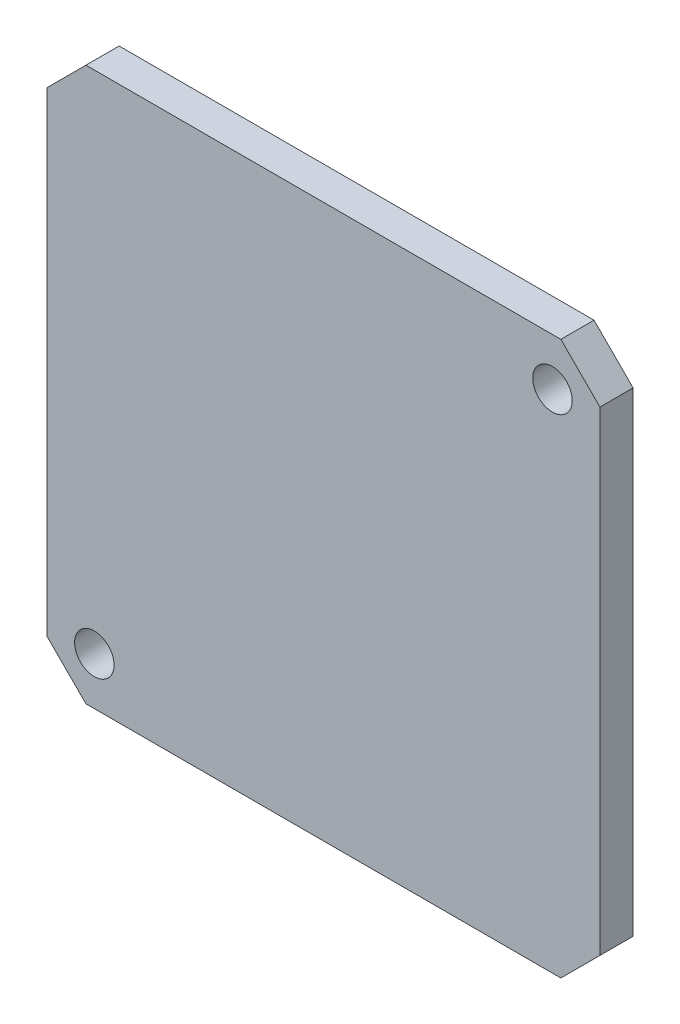
ISO-10303-21;
HEADER;
FILE_DESCRIPTION(('STEP AP214'),'2;1');
FILE_NAME('part.step','',(''),(''),'','','');
FILE_SCHEMA(('AUTOMOTIVE_DESIGN { 1 0 10303 214 1 1 1 1 }'));
ENDSEC;
DATA;
#1=APPLICATION_CONTEXT('core data for automotive mechanical design processes');
#2=APPLICATION_PROTOCOL_DEFINITION('international standard','automotive_design',2000,#1);
#3=PRODUCT_CONTEXT('',#1,'mechanical');
#4=PRODUCT('Part','Part','',(#3));
#5=PRODUCT_RELATED_PRODUCT_CATEGORY('part','',(#4));
#6=PRODUCT_DEFINITION_FORMATION('','',#4);
#7=PRODUCT_DEFINITION_CONTEXT('part definition',#1,'design');
#8=PRODUCT_DEFINITION('design','',#6,#7);
#9=PRODUCT_DEFINITION_SHAPE('','',#8);
#10=(LENGTH_UNIT() NAMED_UNIT(*) SI_UNIT(.MILLI.,.METRE.));
#11=(NAMED_UNIT(*) PLANE_ANGLE_UNIT() SI_UNIT($,.RADIAN.));
#12=(NAMED_UNIT(*) SI_UNIT($,.STERADIAN.) SOLID_ANGLE_UNIT());
#13=UNCERTAINTY_MEASURE_WITH_UNIT(LENGTH_MEASURE(1.E-05),#10,'distance_accuracy_value','');
#14=(GEOMETRIC_REPRESENTATION_CONTEXT(3) GLOBAL_UNCERTAINTY_ASSIGNED_CONTEXT((#13)) GLOBAL_UNIT_ASSIGNED_CONTEXT((#10,
#11,#12)) REPRESENTATION_CONTEXT('',''));
#15=CARTESIAN_POINT('',(0.,0.,0.));
#16=DIRECTION('',(0.,0.,1.));
#17=DIRECTION('',(1.,0.,0.));
#18=AXIS2_PLACEMENT_3D('',#15,#16,#17);
#19=CARTESIAN_POINT('',(0.,0.,2.1));
#20=DIRECTION('',(0.,0.,1.));
#21=DIRECTION('',(1.,0.,0.));
#22=AXIS2_PLACEMENT_3D('',#19,#20,#21);
#23=PLANE('',#22);
#24=CARTESIAN_POINT('',(14.4956890143242,14.4956890143242,2.1));
#25=DIRECTION('',(0.,0.,1.));
#26=DIRECTION('',(1.,0.,0.));
#27=AXIS2_PLACEMENT_3D('',#24,#25,#26);
#28=CIRCLE('',#27,1.25);
#29=CARTESIAN_POINT('',(15.7456890143242,14.4956890143242,2.1));
#30=VERTEX_POINT('',#29);
#31=EDGE_CURVE('E133',#30,#30,#28,.T.);
#32=ORIENTED_EDGE('',*,*,#31,.F.);
#33=EDGE_LOOP('',(#32));
#34=FACE_BOUND('',#33,.T.);
#35=DIRECTION('',(-0.707106781186548,-0.707106781186548,0.));
#36=VECTOR('',#35,1.);
#37=CARTESIAN_POINT('',(-15.0269119345812,17.5,2.1));
#38=LINE('',#37,#36);
#39=CARTESIAN_POINT('',(-15.0269119345812,17.5,2.1));
#40=VERTEX_POINT('',#39);
#41=CARTESIAN_POINT('',(-17.5,15.0269119345812,2.1));
#42=VERTEX_POINT('',#41);
#43=EDGE_CURVE('E144',#40,#42,#38,.T.);
#44=ORIENTED_EDGE('',*,*,#43,.T.);
#45=DIRECTION('',(0.,-1.,0.));
#46=VECTOR('',#45,1.);
#47=CARTESIAN_POINT('',(-17.5,15.0269119345812,2.1));
#48=LINE('',#47,#46);
#49=CARTESIAN_POINT('',(-17.5,-15.0269119345812,2.1));
#50=VERTEX_POINT('',#49);
#51=EDGE_CURVE('E92',#42,#50,#48,.T.);
#52=ORIENTED_EDGE('',*,*,#51,.T.);
#53=DIRECTION('',(0.707106781186548,-0.707106781186548,0.));
#54=VECTOR('',#53,1.);
#55=CARTESIAN_POINT('',(-17.5,-15.0269119345812,2.1));
#56=LINE('',#55,#54);
#57=CARTESIAN_POINT('',(-15.0269119345812,-17.5,2.1));
#58=VERTEX_POINT('',#57);
#59=EDGE_CURVE('E159',#50,#58,#56,.T.);
#60=ORIENTED_EDGE('',*,*,#59,.T.);
#61=DIRECTION('',(1.,0.,0.));
#62=VECTOR('',#61,1.);
#63=CARTESIAN_POINT('',(-15.0269119345812,-17.5,2.1));
#64=LINE('',#63,#62);
#65=CARTESIAN_POINT('',(15.0269119345812,-17.5,2.1));
#66=VERTEX_POINT('',#65);
#67=EDGE_CURVE('E172',#58,#66,#64,.T.);
#68=ORIENTED_EDGE('',*,*,#67,.T.);
#69=DIRECTION('',(0.707106781186548,0.707106781186548,0.));
#70=VECTOR('',#69,1.);
#71=CARTESIAN_POINT('',(15.0269119345812,-17.5,2.1));
#72=LINE('',#71,#70);
#73=CARTESIAN_POINT('',(17.5,-15.0269119345812,2.1));
#74=VERTEX_POINT('',#73);
#75=EDGE_CURVE('E111',#66,#74,#72,.T.);
#76=ORIENTED_EDGE('',*,*,#75,.T.);
#77=DIRECTION('',(0.,1.,0.));
#78=VECTOR('',#77,1.);
#79=CARTESIAN_POINT('',(17.5,-15.0269119345812,2.1));
#80=LINE('',#79,#78);
#81=CARTESIAN_POINT('',(17.5,15.0269119345812,2.1));
#82=VERTEX_POINT('',#81);
#83=EDGE_CURVE('E105',#74,#82,#80,.T.);
#84=ORIENTED_EDGE('',*,*,#83,.T.);
#85=DIRECTION('',(-0.707106781186548,0.707106781186548,0.));
#86=VECTOR('',#85,1.);
#87=CARTESIAN_POINT('',(17.5,15.0269119345812,2.1));
#88=LINE('',#87,#86);
#89=CARTESIAN_POINT('',(15.0269119345812,17.5,2.1));
#90=VERTEX_POINT('',#89);
#91=EDGE_CURVE('E109',#82,#90,#88,.T.);
#92=ORIENTED_EDGE('',*,*,#91,.T.);
#93=DIRECTION('',(-1.,0.,0.));
#94=VECTOR('',#93,1.);
#95=CARTESIAN_POINT('',(15.0269119345812,17.5,2.1));
#96=LINE('',#95,#94);
#97=EDGE_CURVE('E49',#90,#40,#96,.T.);
#98=ORIENTED_EDGE('',*,*,#97,.T.);
#99=EDGE_LOOP('',(#44,#52,#60,#68,#76,#84,#92,#98));
#100=FACE_BOUND('',#99,.T.);
#101=CARTESIAN_POINT('',(-14.4956890143242,-14.4956890143242,2.1));
#102=DIRECTION('',(0.,0.,1.));
#103=DIRECTION('',(1.,0.,0.));
#104=AXIS2_PLACEMENT_3D('',#101,#102,#103);
#105=CIRCLE('',#104,1.25);
#106=CARTESIAN_POINT('',(-13.2456890143242,-14.4956890143242,2.1));
#107=VERTEX_POINT('',#106);
#108=EDGE_CURVE('E181',#107,#107,#105,.T.);
#109=ORIENTED_EDGE('',*,*,#108,.F.);
#110=EDGE_LOOP('',(#109));
#111=FACE_BOUND('',#110,.T.);
#112=ADVANCED_FACE('F32',(#34,#100,#111),#23,.T.);
#113=CARTESIAN_POINT('',(0.,0.,0.));
#114=DIRECTION('',(0.,0.,1.));
#115=DIRECTION('',(1.,0.,0.));
#116=AXIS2_PLACEMENT_3D('',#113,#114,#115);
#117=PLANE('',#116);
#118=DIRECTION('',(-0.707106781186548,-0.707106781186548,0.));
#119=VECTOR('',#118,1.);
#120=CARTESIAN_POINT('',(-15.0269119345812,17.5,0.));
#121=LINE('',#120,#119);
#122=CARTESIAN_POINT('',(-15.0269119345812,17.5,0.));
#123=VERTEX_POINT('',#122);
#124=CARTESIAN_POINT('',(-17.5,15.0269119345812,0.));
#125=VERTEX_POINT('',#124);
#126=EDGE_CURVE('E129',#123,#125,#121,.T.);
#127=ORIENTED_EDGE('',*,*,#126,.F.);
#128=DIRECTION('',(-1.,0.,0.));
#129=VECTOR('',#128,1.);
#130=CARTESIAN_POINT('',(15.0269119345812,17.5,0.));
#131=LINE('',#130,#129);
#132=CARTESIAN_POINT('',(15.0269119345812,17.5,0.));
#133=VERTEX_POINT('',#132);
#134=EDGE_CURVE('E84',#133,#123,#131,.T.);
#135=ORIENTED_EDGE('',*,*,#134,.F.);
#136=DIRECTION('',(-0.707106781186548,0.707106781186548,0.));
#137=VECTOR('',#136,1.);
#138=CARTESIAN_POINT('',(17.5,15.0269119345812,0.));
#139=LINE('',#138,#137);
#140=CARTESIAN_POINT('',(17.5,15.0269119345812,0.));
#141=VERTEX_POINT('',#140);
#142=EDGE_CURVE('E78',#141,#133,#139,.T.);
#143=ORIENTED_EDGE('',*,*,#142,.F.);
#144=DIRECTION('',(0.,1.,0.));
#145=VECTOR('',#144,1.);
#146=CARTESIAN_POINT('',(17.5,-15.0269119345812,0.));
#147=LINE('',#146,#145);
#148=CARTESIAN_POINT('',(17.5,-15.0269119345812,0.));
#149=VERTEX_POINT('',#148);
#150=EDGE_CURVE('E119',#149,#141,#147,.T.);
#151=ORIENTED_EDGE('',*,*,#150,.F.);
#152=DIRECTION('',(0.707106781186548,0.707106781186548,0.));
#153=VECTOR('',#152,1.);
#154=CARTESIAN_POINT('',(15.0269119345812,-17.5,0.));
#155=LINE('',#154,#153);
#156=CARTESIAN_POINT('',(15.0269119345812,-17.5,0.));
#157=VERTEX_POINT('',#156);
#158=EDGE_CURVE('E139',#157,#149,#155,.T.);
#159=ORIENTED_EDGE('',*,*,#158,.F.);
#160=DIRECTION('',(1.,0.,0.));
#161=VECTOR('',#160,1.);
#162=CARTESIAN_POINT('',(-15.0269119345812,-17.5,0.));
#163=LINE('',#162,#161);
#164=CARTESIAN_POINT('',(-15.0269119345812,-17.5,0.));
#165=VERTEX_POINT('',#164);
#166=EDGE_CURVE('E137',#165,#157,#163,.T.);
#167=ORIENTED_EDGE('',*,*,#166,.F.);
#168=DIRECTION('',(0.707106781186548,-0.707106781186548,0.));
#169=VECTOR('',#168,1.);
#170=CARTESIAN_POINT('',(-17.5,-15.0269119345812,0.));
#171=LINE('',#170,#169);
#172=CARTESIAN_POINT('',(-17.5,-15.0269119345812,0.));
#173=VERTEX_POINT('',#172);
#174=EDGE_CURVE('E135',#173,#165,#171,.T.);
#175=ORIENTED_EDGE('',*,*,#174,.F.);
#176=DIRECTION('',(0.,-1.,0.));
#177=VECTOR('',#176,1.);
#178=CARTESIAN_POINT('',(-17.5,15.0269119345812,0.));
#179=LINE('',#178,#177);
#180=EDGE_CURVE('E132',#125,#173,#179,.T.);
#181=ORIENTED_EDGE('',*,*,#180,.F.);
#182=EDGE_LOOP('',(#127,#135,#143,#151,#159,#167,#175,#181));
#183=FACE_BOUND('',#182,.T.);
#184=CARTESIAN_POINT('',(14.4956890143242,14.4956890143242,0.));
#185=DIRECTION('',(0.,0.,1.));
#186=DIRECTION('',(1.,0.,0.));
#187=AXIS2_PLACEMENT_3D('',#184,#185,#186);
#188=CIRCLE('',#187,1.25);
#189=CARTESIAN_POINT('',(15.7456890143242,14.4956890143242,0.));
#190=VERTEX_POINT('',#189);
#191=EDGE_CURVE('E178',#190,#190,#188,.T.);
#192=ORIENTED_EDGE('',*,*,#191,.T.);
#193=EDGE_LOOP('',(#192));
#194=FACE_BOUND('',#193,.T.);
#195=CARTESIAN_POINT('',(-14.4956890143242,-14.4956890143242,0.));
#196=DIRECTION('',(0.,0.,1.));
#197=DIRECTION('',(1.,0.,0.));
#198=AXIS2_PLACEMENT_3D('',#195,#196,#197);
#199=CIRCLE('',#198,1.25);
#200=CARTESIAN_POINT('',(-13.2456890143242,-14.4956890143242,0.));
#201=VERTEX_POINT('',#200);
#202=EDGE_CURVE('E184',#201,#201,#199,.T.);
#203=ORIENTED_EDGE('',*,*,#202,.T.);
#204=EDGE_LOOP('',(#203));
#205=FACE_BOUND('',#204,.T.);
#206=ADVANCED_FACE('F163',(#183,#194,#205),#117,.F.);
#207=CARTESIAN_POINT('',(-15.0269119345812,17.5,2.1));
#208=DIRECTION('',(0.707106781186548,-0.707106781186548,0.));
#209=DIRECTION('',(0.707106781186548,0.707106781186548,0.));
#210=AXIS2_PLACEMENT_3D('',#207,#208,#209);
#211=PLANE('',#210);
#212=ORIENTED_EDGE('',*,*,#126,.T.);
#213=DIRECTION('',(0.,0.,-1.));
#214=VECTOR('',#213,1.);
#215=CARTESIAN_POINT('',(-17.5,15.0269119345812,2.1));
#216=LINE('',#215,#214);
#217=EDGE_CURVE('E11',#42,#125,#216,.T.);
#218=ORIENTED_EDGE('',*,*,#217,.F.);
#219=ORIENTED_EDGE('',*,*,#43,.F.);
#220=DIRECTION('',(0.,0.,-1.));
#221=VECTOR('',#220,1.);
#222=CARTESIAN_POINT('',(-15.0269119345812,17.5,2.1));
#223=LINE('',#222,#221);
#224=EDGE_CURVE('E125',#40,#123,#223,.T.);
#225=ORIENTED_EDGE('',*,*,#224,.T.);
#226=EDGE_LOOP('',(#212,#218,#219,#225));
#227=FACE_BOUND('',#226,.T.);
#228=ADVANCED_FACE('F34',(#227),#211,.F.);
#229=CARTESIAN_POINT('',(-17.5,15.0269119345812,2.1));
#230=DIRECTION('',(1.,0.,0.));
#231=DIRECTION('',(0.,0.,-1.));
#232=AXIS2_PLACEMENT_3D('',#229,#230,#231);
#233=PLANE('',#232);
#234=ORIENTED_EDGE('',*,*,#180,.T.);
#235=DIRECTION('',(0.,0.,-1.));
#236=VECTOR('',#235,1.);
#237=CARTESIAN_POINT('',(-17.5,-15.0269119345812,2.1));
#238=LINE('',#237,#236);
#239=EDGE_CURVE('E41',#50,#173,#238,.T.);
#240=ORIENTED_EDGE('',*,*,#239,.F.);
#241=ORIENTED_EDGE('',*,*,#51,.F.);
#242=ORIENTED_EDGE('',*,*,#217,.T.);
#243=EDGE_LOOP('',(#234,#240,#241,#242));
#244=FACE_BOUND('',#243,.T.);
#245=ADVANCED_FACE('F216',(#244),#233,.F.);
#246=CARTESIAN_POINT('',(-17.5,-15.0269119345812,2.1));
#247=DIRECTION('',(0.707106781186548,0.707106781186548,0.));
#248=DIRECTION('',(-0.707106781186548,0.707106781186548,0.));
#249=AXIS2_PLACEMENT_3D('',#246,#247,#248);
#250=PLANE('',#249);
#251=ORIENTED_EDGE('',*,*,#174,.T.);
#252=DIRECTION('',(0.,0.,-1.));
#253=VECTOR('',#252,1.);
#254=CARTESIAN_POINT('',(-15.0269119345812,-17.5,2.1));
#255=LINE('',#254,#253);
#256=EDGE_CURVE('E151',#58,#165,#255,.T.);
#257=ORIENTED_EDGE('',*,*,#256,.F.);
#258=ORIENTED_EDGE('',*,*,#59,.F.);
#259=ORIENTED_EDGE('',*,*,#239,.T.);
#260=EDGE_LOOP('',(#251,#257,#258,#259));
#261=FACE_BOUND('',#260,.T.);
#262=ADVANCED_FACE('F157',(#261),#250,.F.);
#263=CARTESIAN_POINT('',(-15.0269119345812,-17.5,2.1));
#264=DIRECTION('',(0.,1.,0.));
#265=DIRECTION('',(0.,0.,1.));
#266=AXIS2_PLACEMENT_3D('',#263,#264,#265);
#267=PLANE('',#266);
#268=ORIENTED_EDGE('',*,*,#166,.T.);
#269=DIRECTION('',(0.,0.,-1.));
#270=VECTOR('',#269,1.);
#271=CARTESIAN_POINT('',(15.0269119345812,-17.5,2.1));
#272=LINE('',#271,#270);
#273=EDGE_CURVE('E148',#66,#157,#272,.T.);
#274=ORIENTED_EDGE('',*,*,#273,.F.);
#275=ORIENTED_EDGE('',*,*,#67,.F.);
#276=ORIENTED_EDGE('',*,*,#256,.T.);
#277=EDGE_LOOP('',(#268,#274,#275,#276));
#278=FACE_BOUND('',#277,.T.);
#279=ADVANCED_FACE('F168',(#278),#267,.F.);
#280=CARTESIAN_POINT('',(15.0269119345812,-17.5,2.1));
#281=DIRECTION('',(-0.707106781186548,0.707106781186548,0.));
#282=DIRECTION('',(-0.707106781186548,-0.707106781186548,0.));
#283=AXIS2_PLACEMENT_3D('',#280,#281,#282);
#284=PLANE('',#283);
#285=ORIENTED_EDGE('',*,*,#158,.T.);
#286=DIRECTION('',(0.,0.,-1.));
#287=VECTOR('',#286,1.);
#288=CARTESIAN_POINT('',(17.5,-15.0269119345812,2.1));
#289=LINE('',#288,#287);
#290=EDGE_CURVE('E120',#74,#149,#289,.T.);
#291=ORIENTED_EDGE('',*,*,#290,.F.);
#292=ORIENTED_EDGE('',*,*,#75,.F.);
#293=ORIENTED_EDGE('',*,*,#273,.T.);
#294=EDGE_LOOP('',(#285,#291,#292,#293));
#295=FACE_BOUND('',#294,.T.);
#296=ADVANCED_FACE('F171',(#295),#284,.F.);
#297=CARTESIAN_POINT('',(17.5,-15.0269119345812,2.1));
#298=DIRECTION('',(-1.,0.,0.));
#299=DIRECTION('',(0.,0.,1.));
#300=AXIS2_PLACEMENT_3D('',#297,#298,#299);
#301=PLANE('',#300);
#302=ORIENTED_EDGE('',*,*,#150,.T.);
#303=DIRECTION('',(0.,0.,-1.));
#304=VECTOR('',#303,1.);
#305=CARTESIAN_POINT('',(17.5,15.0269119345812,2.1));
#306=LINE('',#305,#304);
#307=EDGE_CURVE('E116',#82,#141,#306,.T.);
#308=ORIENTED_EDGE('',*,*,#307,.F.);
#309=ORIENTED_EDGE('',*,*,#83,.F.);
#310=ORIENTED_EDGE('',*,*,#290,.T.);
#311=EDGE_LOOP('',(#302,#308,#309,#310));
#312=FACE_BOUND('',#311,.T.);
#313=ADVANCED_FACE('F117',(#312),#301,.F.);
#314=CARTESIAN_POINT('',(17.5,15.0269119345812,2.1));
#315=DIRECTION('',(-0.707106781186548,-0.707106781186548,0.));
#316=DIRECTION('',(0.707106781186548,-0.707106781186548,0.));
#317=AXIS2_PLACEMENT_3D('',#314,#315,#316);
#318=PLANE('',#317);
#319=ORIENTED_EDGE('',*,*,#142,.T.);
#320=DIRECTION('',(0.,0.,-1.));
#321=VECTOR('',#320,1.);
#322=CARTESIAN_POINT('',(15.0269119345812,17.5,2.1));
#323=LINE('',#322,#321);
#324=EDGE_CURVE('E121',#90,#133,#323,.T.);
#325=ORIENTED_EDGE('',*,*,#324,.F.);
#326=ORIENTED_EDGE('',*,*,#91,.F.);
#327=ORIENTED_EDGE('',*,*,#307,.T.);
#328=EDGE_LOOP('',(#319,#325,#326,#327));
#329=FACE_BOUND('',#328,.T.);
#330=ADVANCED_FACE('F123',(#329),#318,.F.);
#331=CARTESIAN_POINT('',(15.0269119345812,17.5,2.1));
#332=DIRECTION('',(0.,-1.,0.));
#333=DIRECTION('',(0.,0.,-1.));
#334=AXIS2_PLACEMENT_3D('',#331,#332,#333);
#335=PLANE('',#334);
#336=ORIENTED_EDGE('',*,*,#134,.T.);
#337=ORIENTED_EDGE('',*,*,#224,.F.);
#338=ORIENTED_EDGE('',*,*,#97,.F.);
#339=ORIENTED_EDGE('',*,*,#324,.T.);
#340=EDGE_LOOP('',(#336,#337,#338,#339));
#341=FACE_BOUND('',#340,.T.);
#342=ADVANCED_FACE('F204',(#341),#335,.F.);
#343=CARTESIAN_POINT('',(14.4956890143242,14.4956890143242,2.1));
#344=DIRECTION('',(0.,0.,-1.));
#345=DIRECTION('',(-1.,0.,0.));
#346=AXIS2_PLACEMENT_3D('',#343,#344,#345);
#347=CYLINDRICAL_SURFACE('',#346,1.25);
#348=ORIENTED_EDGE('',*,*,#31,.T.);
#349=EDGE_LOOP('',(#348));
#350=FACE_BOUND('',#349,.T.);
#351=ORIENTED_EDGE('',*,*,#191,.F.);
#352=EDGE_LOOP('',(#351));
#353=FACE_BOUND('',#352,.T.);
#354=ADVANCED_FACE('F201',(#350,#353),#347,.F.);
#355=CARTESIAN_POINT('',(-14.4956890143242,-14.4956890143242,2.1));
#356=DIRECTION('',(0.,0.,-1.));
#357=DIRECTION('',(-1.,0.,0.));
#358=AXIS2_PLACEMENT_3D('',#355,#356,#357);
#359=CYLINDRICAL_SURFACE('',#358,1.25);
#360=ORIENTED_EDGE('',*,*,#108,.T.);
#361=EDGE_LOOP('',(#360));
#362=FACE_BOUND('',#361,.T.);
#363=ORIENTED_EDGE('',*,*,#202,.F.);
#364=EDGE_LOOP('',(#363));
#365=FACE_BOUND('',#364,.T.);
#366=ADVANCED_FACE('F190',(#362,#365),#359,.F.);
#367=CLOSED_SHELL('',(#112,#206,#228,#245,#262,#279,#296,#313,#330,#342,#354,#366));
#368=MANIFOLD_SOLID_BREP('B2',#367);
#369=ADVANCED_BREP_SHAPE_REPRESENTATION('',(#18,#368),#14);
#370=SHAPE_DEFINITION_REPRESENTATION(#9,#369);
ENDSEC;
END-ISO-10303-21;
